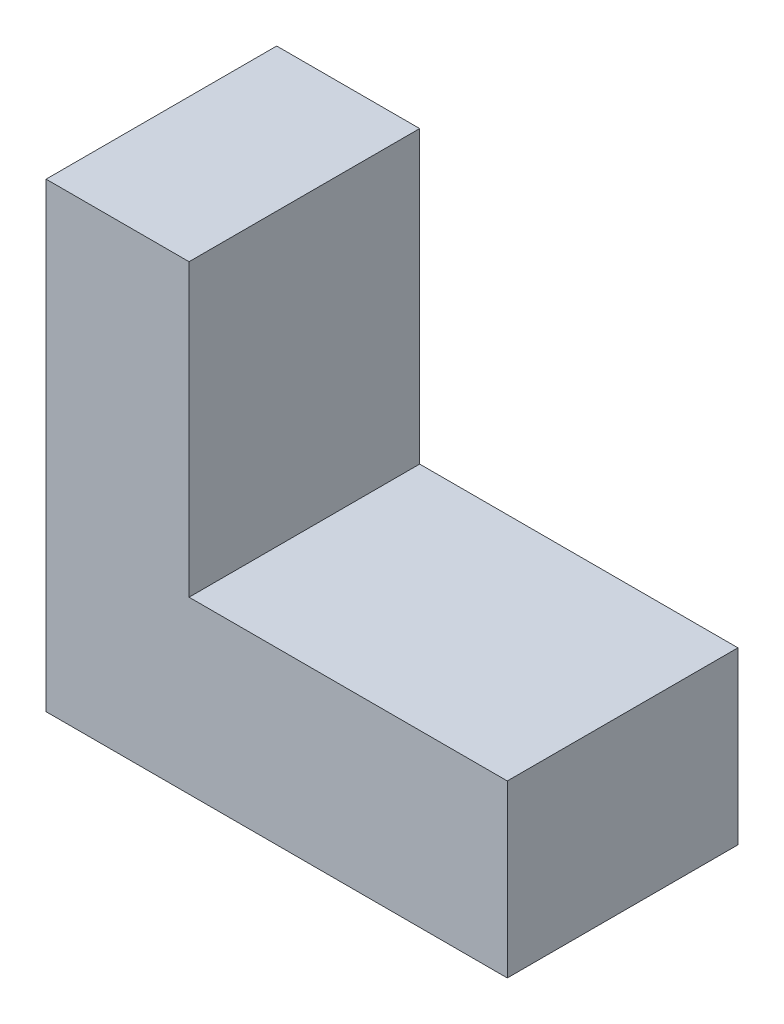
ISO-10303-21;
HEADER;
FILE_DESCRIPTION(('STEP AP214'),'2;1');
FILE_NAME('part.step','',(''),(''),'','','');
FILE_SCHEMA(('AUTOMOTIVE_DESIGN { 1 0 10303 214 1 1 1 1 }'));
ENDSEC;
DATA;
#1=APPLICATION_CONTEXT('core data for automotive mechanical design processes');
#2=APPLICATION_PROTOCOL_DEFINITION('international standard','automotive_design',2000,#1);
#3=PRODUCT_CONTEXT('',#1,'mechanical');
#4=PRODUCT('Part','Part','',(#3));
#5=PRODUCT_RELATED_PRODUCT_CATEGORY('part','',(#4));
#6=PRODUCT_DEFINITION_FORMATION('','',#4);
#7=PRODUCT_DEFINITION_CONTEXT('part definition',#1,'design');
#8=PRODUCT_DEFINITION('design','',#6,#7);
#9=PRODUCT_DEFINITION_SHAPE('','',#8);
#10=(LENGTH_UNIT() NAMED_UNIT(*) SI_UNIT(.MILLI.,.METRE.));
#11=(NAMED_UNIT(*) PLANE_ANGLE_UNIT() SI_UNIT($,.RADIAN.));
#12=(NAMED_UNIT(*) SI_UNIT($,.STERADIAN.) SOLID_ANGLE_UNIT());
#13=UNCERTAINTY_MEASURE_WITH_UNIT(LENGTH_MEASURE(1.E-05),#10,'distance_accuracy_value','');
#14=(GEOMETRIC_REPRESENTATION_CONTEXT(3) GLOBAL_UNCERTAINTY_ASSIGNED_CONTEXT((#13)) GLOBAL_UNIT_ASSIGNED_CONTEXT((#10,
#11,#12)) REPRESENTATION_CONTEXT('',''));
#15=CARTESIAN_POINT('',(0.,0.,0.));
#16=DIRECTION('',(0.,0.,1.));
#17=DIRECTION('',(1.,0.,0.));
#18=AXIS2_PLACEMENT_3D('',#15,#16,#17);
#19=CARTESIAN_POINT('',(0.,0.,25.));
#20=DIRECTION('',(1.,0.,0.));
#21=DIRECTION('',(0.,0.,-1.));
#22=AXIS2_PLACEMENT_3D('',#19,#20,#21);
#23=PLANE('',#22);
#24=DIRECTION('',(0.,-1.,0.));
#25=VECTOR('',#24,1.);
#26=CARTESIAN_POINT('',(0.,0.,0.));
#27=LINE('',#26,#25);
#28=CARTESIAN_POINT('',(0.,50.,0.));
#29=VERTEX_POINT('',#28);
#30=CARTESIAN_POINT('',(0.,0.,0.));
#31=VERTEX_POINT('',#30);
#32=EDGE_CURVE('E87',#29,#31,#27,.T.);
#33=ORIENTED_EDGE('',*,*,#32,.T.);
#34=DIRECTION('',(0.,0.,-1.));
#35=VECTOR('',#34,1.);
#36=CARTESIAN_POINT('',(0.,0.,25.));
#37=LINE('',#36,#35);
#38=CARTESIAN_POINT('',(0.,0.,25.));
#39=VERTEX_POINT('',#38);
#40=EDGE_CURVE('E11',#39,#31,#37,.T.);
#41=ORIENTED_EDGE('',*,*,#40,.F.);
#42=DIRECTION('',(0.,-1.,0.));
#43=VECTOR('',#42,1.);
#44=CARTESIAN_POINT('',(0.,0.,25.));
#45=LINE('',#44,#43);
#46=CARTESIAN_POINT('',(0.,50.,25.));
#47=VERTEX_POINT('',#46);
#48=EDGE_CURVE('E109',#47,#39,#45,.T.);
#49=ORIENTED_EDGE('',*,*,#48,.F.);
#50=DIRECTION('',(0.,0.,-1.));
#51=VECTOR('',#50,1.);
#52=CARTESIAN_POINT('',(0.,50.,0.));
#53=LINE('',#52,#51);
#54=EDGE_CURVE('E103',#47,#29,#53,.T.);
#55=ORIENTED_EDGE('',*,*,#54,.T.);
#56=EDGE_LOOP('',(#33,#41,#49,#55));
#57=FACE_BOUND('',#56,.T.);
#58=ADVANCED_FACE('F35',(#57),#23,.F.);
#59=CARTESIAN_POINT('',(0.,0.,25.));
#60=DIRECTION('',(0.,1.,0.));
#61=DIRECTION('',(0.,0.,1.));
#62=AXIS2_PLACEMENT_3D('',#59,#60,#61);
#63=PLANE('',#62);
#64=DIRECTION('',(0.,0.,-1.));
#65=VECTOR('',#64,1.);
#66=CARTESIAN_POINT('',(50.,0.,25.));
#67=LINE('',#66,#65);
#68=CARTESIAN_POINT('',(50.,0.,25.));
#69=VERTEX_POINT('',#68);
#70=CARTESIAN_POINT('',(50.,0.,0.));
#71=VERTEX_POINT('',#70);
#72=EDGE_CURVE('E42',#69,#71,#67,.T.);
#73=ORIENTED_EDGE('',*,*,#72,.F.);
#74=DIRECTION('',(1.,0.,0.));
#75=VECTOR('',#74,1.);
#76=CARTESIAN_POINT('',(0.,0.,25.));
#77=LINE('',#76,#75);
#78=EDGE_CURVE('E122',#39,#69,#77,.T.);
#79=ORIENTED_EDGE('',*,*,#78,.F.);
#80=ORIENTED_EDGE('',*,*,#40,.T.);
#81=DIRECTION('',(1.,0.,0.));
#82=VECTOR('',#81,1.);
#83=CARTESIAN_POINT('',(0.,0.,0.));
#84=LINE('',#83,#82);
#85=EDGE_CURVE('E93',#31,#71,#84,.T.);
#86=ORIENTED_EDGE('',*,*,#85,.T.);
#87=EDGE_LOOP('',(#73,#79,#80,#86));
#88=FACE_BOUND('',#87,.T.);
#89=ADVANCED_FACE('F152',(#88),#63,.F.);
#90=CARTESIAN_POINT('',(50.,0.,25.));
#91=DIRECTION('',(-1.,0.,0.));
#92=DIRECTION('',(0.,0.,1.));
#93=AXIS2_PLACEMENT_3D('',#90,#91,#92);
#94=PLANE('',#93);
#95=DIRECTION('',(0.,1.,0.));
#96=VECTOR('',#95,1.);
#97=CARTESIAN_POINT('',(50.,0.,0.));
#98=LINE('',#97,#96);
#99=CARTESIAN_POINT('',(50.,18.5,0.));
#100=VERTEX_POINT('',#99);
#101=EDGE_CURVE('E130',#71,#100,#98,.T.);
#102=ORIENTED_EDGE('',*,*,#101,.T.);
#103=DIRECTION('',(0.,0.,-1.));
#104=VECTOR('',#103,1.);
#105=CARTESIAN_POINT('',(50.,18.5,25.));
#106=LINE('',#105,#104);
#107=CARTESIAN_POINT('',(50.,18.5,25.));
#108=VERTEX_POINT('',#107);
#109=EDGE_CURVE('E127',#108,#100,#106,.T.);
#110=ORIENTED_EDGE('',*,*,#109,.F.);
#111=DIRECTION('',(0.,1.,0.));
#112=VECTOR('',#111,1.);
#113=CARTESIAN_POINT('',(50.,0.,25.));
#114=LINE('',#113,#112);
#115=EDGE_CURVE('E124',#69,#108,#114,.T.);
#116=ORIENTED_EDGE('',*,*,#115,.F.);
#117=ORIENTED_EDGE('',*,*,#72,.T.);
#118=EDGE_LOOP('',(#102,#110,#116,#117));
#119=FACE_BOUND('',#118,.T.);
#120=ADVANCED_FACE('F137',(#119),#94,.F.);
#121=CARTESIAN_POINT('',(0.,18.5,25.));
#122=DIRECTION('',(0.,-1.,0.));
#123=DIRECTION('',(0.,0.,-1.));
#124=AXIS2_PLACEMENT_3D('',#121,#122,#123);
#125=PLANE('',#124);
#126=DIRECTION('',(-1.,0.,0.));
#127=VECTOR('',#126,1.);
#128=CARTESIAN_POINT('',(0.,18.5,0.));
#129=LINE('',#128,#127);
#130=CARTESIAN_POINT('',(15.5,18.5,0.));
#131=VERTEX_POINT('',#130);
#132=EDGE_CURVE('E54',#100,#131,#129,.T.);
#133=ORIENTED_EDGE('',*,*,#132,.T.);
#134=DIRECTION('',(0.,0.,1.));
#135=VECTOR('',#134,1.);
#136=CARTESIAN_POINT('',(15.5,18.5,25.));
#137=LINE('',#136,#135);
#138=CARTESIAN_POINT('',(15.5,18.5,25.));
#139=VERTEX_POINT('',#138);
#140=EDGE_CURVE('E49',#131,#139,#137,.T.);
#141=ORIENTED_EDGE('',*,*,#140,.T.);
#142=DIRECTION('',(-1.,0.,0.));
#143=VECTOR('',#142,1.);
#144=CARTESIAN_POINT('',(0.,18.5,25.));
#145=LINE('',#144,#143);
#146=EDGE_CURVE('E126',#108,#139,#145,.T.);
#147=ORIENTED_EDGE('',*,*,#146,.F.);
#148=ORIENTED_EDGE('',*,*,#109,.T.);
#149=EDGE_LOOP('',(#133,#141,#147,#148));
#150=FACE_BOUND('',#149,.T.);
#151=ADVANCED_FACE('F144',(#150),#125,.F.);
#152=CARTESIAN_POINT('',(0.,18.5,25.));
#153=DIRECTION('',(0.,0.,-1.));
#154=DIRECTION('',(-1.,0.,0.));
#155=AXIS2_PLACEMENT_3D('',#152,#153,#154);
#156=PLANE('',#155);
#157=ORIENTED_EDGE('',*,*,#146,.T.);
#158=DIRECTION('',(0.,-1.,0.));
#159=VECTOR('',#158,1.);
#160=CARTESIAN_POINT('',(15.5,50.,25.));
#161=LINE('',#160,#159);
#162=CARTESIAN_POINT('',(15.5,50.,25.));
#163=VERTEX_POINT('',#162);
#164=EDGE_CURVE('E116',#163,#139,#161,.T.);
#165=ORIENTED_EDGE('',*,*,#164,.F.);
#166=DIRECTION('',(-1.,0.,0.));
#167=VECTOR('',#166,1.);
#168=CARTESIAN_POINT('',(0.,50.,25.));
#169=LINE('',#168,#167);
#170=EDGE_CURVE('E113',#163,#47,#169,.T.);
#171=ORIENTED_EDGE('',*,*,#170,.T.);
#172=ORIENTED_EDGE('',*,*,#48,.T.);
#173=ORIENTED_EDGE('',*,*,#78,.T.);
#174=ORIENTED_EDGE('',*,*,#115,.T.);
#175=EDGE_LOOP('',(#157,#165,#171,#172,#173,#174));
#176=FACE_BOUND('',#175,.T.);
#177=ADVANCED_FACE('F143',(#176),#156,.F.);
#178=CARTESIAN_POINT('',(0.,18.5,0.));
#179=DIRECTION('',(0.,0.,-1.));
#180=DIRECTION('',(-1.,0.,0.));
#181=AXIS2_PLACEMENT_3D('',#178,#179,#180);
#182=PLANE('',#181);
#183=ORIENTED_EDGE('',*,*,#101,.F.);
#184=ORIENTED_EDGE('',*,*,#85,.F.);
#185=ORIENTED_EDGE('',*,*,#32,.F.);
#186=DIRECTION('',(1.,0.,0.));
#187=VECTOR('',#186,1.);
#188=CARTESIAN_POINT('',(0.,50.,0.));
#189=LINE('',#188,#187);
#190=CARTESIAN_POINT('',(15.5,50.,0.));
#191=VERTEX_POINT('',#190);
#192=EDGE_CURVE('E92',#29,#191,#189,.T.);
#193=ORIENTED_EDGE('',*,*,#192,.T.);
#194=DIRECTION('',(0.,-1.,0.));
#195=VECTOR('',#194,1.);
#196=CARTESIAN_POINT('',(15.5,50.,0.));
#197=LINE('',#196,#195);
#198=EDGE_CURVE('E115',#191,#131,#197,.T.);
#199=ORIENTED_EDGE('',*,*,#198,.T.);
#200=ORIENTED_EDGE('',*,*,#132,.F.);
#201=EDGE_LOOP('',(#183,#184,#185,#193,#199,#200));
#202=FACE_BOUND('',#201,.T.);
#203=ADVANCED_FACE('F90',(#202),#182,.T.);
#204=CARTESIAN_POINT('',(15.5,50.,0.));
#205=DIRECTION('',(1.,0.,0.));
#206=DIRECTION('',(0.,0.,-1.));
#207=AXIS2_PLACEMENT_3D('',#204,#205,#206);
#208=PLANE('',#207);
#209=ORIENTED_EDGE('',*,*,#140,.F.);
#210=ORIENTED_EDGE('',*,*,#198,.F.);
#211=DIRECTION('',(0.,0.,1.));
#212=VECTOR('',#211,1.);
#213=CARTESIAN_POINT('',(15.5,50.,0.));
#214=LINE('',#213,#212);
#215=EDGE_CURVE('E106',#191,#163,#214,.T.);
#216=ORIENTED_EDGE('',*,*,#215,.T.);
#217=ORIENTED_EDGE('',*,*,#164,.T.);
#218=EDGE_LOOP('',(#209,#210,#216,#217));
#219=FACE_BOUND('',#218,.T.);
#220=ADVANCED_FACE('F141',(#219),#208,.T.);
#221=CARTESIAN_POINT('',(0.,50.,25.));
#222=DIRECTION('',(0.,1.,0.));
#223=DIRECTION('',(0.,0.,1.));
#224=AXIS2_PLACEMENT_3D('',#221,#222,#223);
#225=PLANE('',#224);
#226=ORIENTED_EDGE('',*,*,#54,.F.);
#227=ORIENTED_EDGE('',*,*,#170,.F.);
#228=ORIENTED_EDGE('',*,*,#215,.F.);
#229=ORIENTED_EDGE('',*,*,#192,.F.);
#230=EDGE_LOOP('',(#226,#227,#228,#229));
#231=FACE_BOUND('',#230,.T.);
#232=ADVANCED_FACE('F101',(#231),#225,.T.);
#233=CLOSED_SHELL('',(#58,#89,#120,#151,#177,#203,#220,#232));
#234=MANIFOLD_SOLID_BREP('B2',#233);
#235=ADVANCED_BREP_SHAPE_REPRESENTATION('',(#18,#234),#14);
#236=SHAPE_DEFINITION_REPRESENTATION(#9,#235);
ENDSEC;
END-ISO-10303-21;
